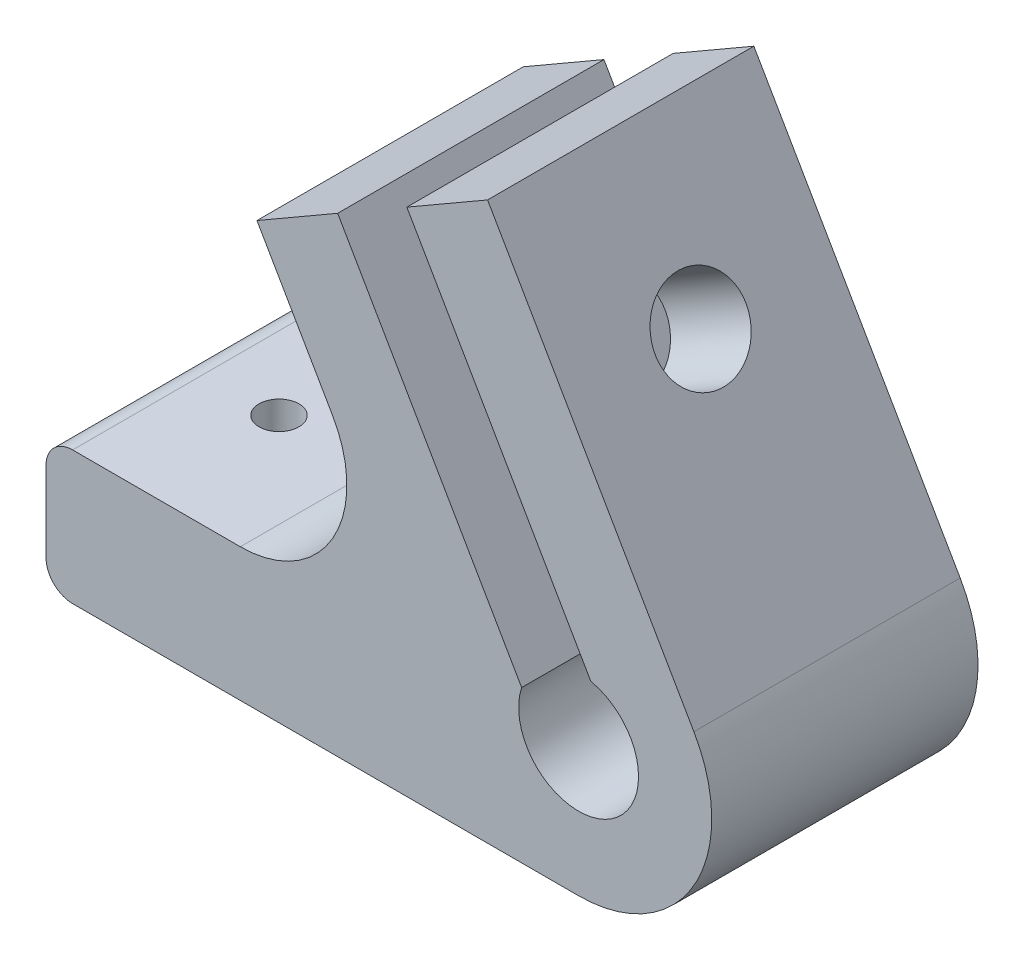
ISO-10303-21;
HEADER;
FILE_DESCRIPTION(('STEP AP214'),'2;1');
FILE_NAME('part.step','',(''),(''),'','','');
FILE_SCHEMA(('AUTOMOTIVE_DESIGN { 1 0 10303 214 1 1 1 1 }'));
ENDSEC;
DATA;
#1=APPLICATION_CONTEXT('core data for automotive mechanical design processes');
#2=APPLICATION_PROTOCOL_DEFINITION('international standard','automotive_design',2000,#1);
#3=PRODUCT_CONTEXT('',#1,'mechanical');
#4=PRODUCT('Part','Part','',(#3));
#5=PRODUCT_RELATED_PRODUCT_CATEGORY('part','',(#4));
#6=PRODUCT_DEFINITION_FORMATION('','',#4);
#7=PRODUCT_DEFINITION_CONTEXT('part definition',#1,'design');
#8=PRODUCT_DEFINITION('design','',#6,#7);
#9=PRODUCT_DEFINITION_SHAPE('','',#8);
#10=(LENGTH_UNIT() NAMED_UNIT(*) SI_UNIT(.MILLI.,.METRE.));
#11=(NAMED_UNIT(*) PLANE_ANGLE_UNIT() SI_UNIT($,.RADIAN.));
#12=(NAMED_UNIT(*) SI_UNIT($,.STERADIAN.) SOLID_ANGLE_UNIT());
#13=UNCERTAINTY_MEASURE_WITH_UNIT(LENGTH_MEASURE(1.E-05),#10,'distance_accuracy_value','');
#14=(GEOMETRIC_REPRESENTATION_CONTEXT(3) GLOBAL_UNCERTAINTY_ASSIGNED_CONTEXT((#13)) GLOBAL_UNIT_ASSIGNED_CONTEXT((#10,
#11,#12)) REPRESENTATION_CONTEXT('',''));
#15=CARTESIAN_POINT('',(0.,0.,0.));
#16=DIRECTION('',(0.,0.,1.));
#17=DIRECTION('',(1.,0.,0.));
#18=AXIS2_PLACEMENT_3D('',#15,#16,#17);
#19=CARTESIAN_POINT('',(671.535898384841,387.71143170301,0.));
#20=DIRECTION('',(0.866025403784425,0.500000000000023,0.));
#21=DIRECTION('',(-0.500000000000023,0.866025403784425,0.));
#22=AXIS2_PLACEMENT_3D('',#19,#20,#21);
#23=PLANE('',#22);
#24=DIRECTION('',(0.,0.,1.));
#25=VECTOR('',#24,1.);
#26=CARTESIAN_POINT('',(890.35832267251,8.69987500139835,3.35000000000008));
#27=LINE('',#26,#25);
#28=CARTESIAN_POINT('',(890.35832267251,8.69987500139835,3.35000000000008));
#29=VERTEX_POINT('',#28);
#30=CARTESIAN_POINT('',(890.35832267251,8.69987500139835,6.65));
#31=VERTEX_POINT('',#30);
#32=EDGE_CURVE('E217',#29,#31,#27,.T.);
#33=ORIENTED_EDGE('',*,*,#32,.F.);
#34=DIRECTION('',(-0.433012701892207,0.749999999999974,0.500000000000049));
#35=VECTOR('',#34,1.);
#36=CARTESIAN_POINT('',(891.787264588754,6.22487500139857,1.7));
#37=LINE('',#36,#35);
#38=CARTESIAN_POINT('',(891.787264588754,6.22487500139857,1.7));
#39=VERTEX_POINT('',#38);
#40=EDGE_CURVE('E232',#39,#29,#37,.T.);
#41=ORIENTED_EDGE('',*,*,#40,.F.);
#42=DIRECTION('',(-0.433012701892212,0.749999999999983,-0.500000000000032));
#43=VECTOR('',#42,1.);
#44=CARTESIAN_POINT('',(893.216206504998,3.74987500139878,3.35));
#45=LINE('',#44,#43);
#46=CARTESIAN_POINT('',(893.216206504998,3.74987500139878,3.35));
#47=VERTEX_POINT('',#46);
#48=EDGE_CURVE('E229',#47,#39,#45,.T.);
#49=ORIENTED_EDGE('',*,*,#48,.F.);
#50=DIRECTION('',(0.,0.,-1.));
#51=VECTOR('',#50,1.);
#52=CARTESIAN_POINT('',(893.216206504998,3.74987500139878,6.65));
#53=LINE('',#52,#51);
#54=CARTESIAN_POINT('',(893.216206504998,3.74987500139878,6.65));
#55=VERTEX_POINT('',#54);
#56=EDGE_CURVE('E226',#55,#47,#53,.T.);
#57=ORIENTED_EDGE('',*,*,#56,.F.);
#58=DIRECTION('',(0.433012701892198,-0.749999999999999,-0.500000000000021));
#59=VECTOR('',#58,1.);
#60=CARTESIAN_POINT('',(891.787264588754,6.22487500139851,8.29999999999989));
#61=LINE('',#60,#59);
#62=CARTESIAN_POINT('',(891.787264588754,6.22487500139851,8.29999999999989));
#63=VERTEX_POINT('',#62);
#64=EDGE_CURVE('E223',#63,#55,#61,.T.);
#65=ORIENTED_EDGE('',*,*,#64,.F.);
#66=DIRECTION('',(0.433012701892241,-0.749999999999991,0.499999999999993));
#67=VECTOR('',#66,1.);
#68=CARTESIAN_POINT('',(890.35832267251,8.69987500139835,6.65));
#69=LINE('',#68,#67);
#70=EDGE_CURVE('E220',#31,#63,#69,.T.);
#71=ORIENTED_EDGE('',*,*,#70,.F.);
#72=EDGE_LOOP('',(#33,#41,#49,#57,#65,#71));
#73=FACE_BOUND('',#72,.T.);
#74=CARTESIAN_POINT('',(891.787264588654,6.22487500145746,5.));
#75=DIRECTION('',(-0.86602540378449,-0.499999999999911,0.));
#76=DIRECTION('',(0.499999999999911,-0.86602540378449,0.));
#77=AXIS2_PLACEMENT_3D('',#74,#75,#76);
#78=CIRCLE('',#77,1.7);
#79=CARTESIAN_POINT('',(892.637264588654,4.75263181502383,5.));
#80=VERTEX_POINT('',#79);
#81=EDGE_CURVE('E200',#80,#80,#78,.T.);
#82=ORIENTED_EDGE('',*,*,#81,.F.);
#83=EDGE_LOOP('',(#82));
#84=FACE_BOUND('',#83,.T.);
#85=ADVANCED_FACE('F33',(#73,#84),#23,.F.);
#86=CARTESIAN_POINT('',(896.581493222814,15.9210274241055,0.));
#87=DIRECTION('',(-0.499999999999976,0.866025403784452,0.));
#88=DIRECTION('',(-0.866025403784452,-0.499999999999976,0.));
#89=AXIS2_PLACEMENT_3D('',#86,#87,#88);
#90=PLANE('',#89);
#91=DIRECTION('',(0.,0.,-1.));
#92=VECTOR('',#91,1.);
#93=CARTESIAN_POINT('',(890.952328098215,12.6710274241055,10.));
#94=LINE('',#93,#92);
#95=CARTESIAN_POINT('',(890.952328098215,12.6710274241055,10.));
#96=VERTEX_POINT('',#95);
#97=CARTESIAN_POINT('',(890.952328098215,12.6710274241055,0.));
#98=VERTEX_POINT('',#97);
#99=EDGE_CURVE('E260',#96,#98,#94,.T.);
#100=ORIENTED_EDGE('',*,*,#99,.T.);
#101=DIRECTION('',(-0.866025403784452,-0.499999999999976,0.));
#102=VECTOR('',#101,1.);
#103=CARTESIAN_POINT('',(896.581493222814,15.9210274241055,0.));
#104=LINE('',#103,#102);
#105=CARTESIAN_POINT('',(887.921239184969,10.9210274241055,0.));
#106=VERTEX_POINT('',#105);
#107=EDGE_CURVE('E281',#98,#106,#104,.T.);
#108=ORIENTED_EDGE('',*,*,#107,.T.);
#109=DIRECTION('',(0.,0.,1.));
#110=VECTOR('',#109,1.);
#111=CARTESIAN_POINT('',(887.921239184969,10.9210274241055,0.));
#112=LINE('',#111,#110);
#113=CARTESIAN_POINT('',(887.921239184969,10.9210274241055,10.));
#114=VERTEX_POINT('',#113);
#115=EDGE_CURVE('E329',#106,#114,#112,.T.);
#116=ORIENTED_EDGE('',*,*,#115,.T.);
#117=DIRECTION('',(-0.866025403784452,-0.499999999999976,0.));
#118=VECTOR('',#117,1.);
#119=CARTESIAN_POINT('',(896.581493222814,15.9210274241055,10.));
#120=LINE('',#119,#118);
#121=EDGE_CURVE('E304',#96,#114,#120,.T.);
#122=ORIENTED_EDGE('',*,*,#121,.F.);
#123=EDGE_LOOP('',(#100,#108,#116,#122));
#124=FACE_BOUND('',#123,.T.);
#125=ADVANCED_FACE('F360',(#124),#90,.T.);
#126=CARTESIAN_POINT('',(900.,0.,0.));
#127=DIRECTION('',(0.,0.,1.));
#128=DIRECTION('',(1.,0.,0.));
#129=AXIS2_PLACEMENT_3D('',#126,#127,#128);
#130=CYLINDRICAL_SURFACE('',#129,4.99999999999991);
#131=CARTESIAN_POINT('',(900.,0.,10.));
#132=DIRECTION('',(0.,0.,1.));
#133=DIRECTION('',(1.,0.,0.));
#134=AXIS2_PLACEMENT_3D('',#131,#132,#133);
#135=CIRCLE('',#134,4.99999999999991);
#136=CARTESIAN_POINT('',(900.,-5.,10.));
#137=VERTEX_POINT('',#136);
#138=CARTESIAN_POINT('',(904.330127018922,2.50000000000005,10.));
#139=VERTEX_POINT('',#138);
#140=EDGE_CURVE('E267',#137,#139,#135,.T.);
#141=ORIENTED_EDGE('',*,*,#140,.F.);
#142=DIRECTION('',(0.,0.,1.));
#143=VECTOR('',#142,1.);
#144=CARTESIAN_POINT('',(900.,-5.,0.));
#145=LINE('',#144,#143);
#146=CARTESIAN_POINT('',(900.,-5.,0.));
#147=VERTEX_POINT('',#146);
#148=EDGE_CURVE('E192',#147,#137,#145,.T.);
#149=ORIENTED_EDGE('',*,*,#148,.F.);
#150=CARTESIAN_POINT('',(900.,0.,0.));
#151=DIRECTION('',(0.,0.,1.));
#152=DIRECTION('',(1.,0.,0.));
#153=AXIS2_PLACEMENT_3D('',#150,#151,#152);
#154=CIRCLE('',#153,4.99999999999991);
#155=CARTESIAN_POINT('',(904.330127018922,2.50000000000005,0.));
#156=VERTEX_POINT('',#155);
#157=EDGE_CURVE('E274',#147,#156,#154,.T.);
#158=ORIENTED_EDGE('',*,*,#157,.T.);
#159=DIRECTION('',(0.,0.,1.));
#160=VECTOR('',#159,1.);
#161=CARTESIAN_POINT('',(904.330127018922,2.50000000000005,0.));
#162=LINE('',#161,#160);
#163=EDGE_CURVE('E298',#156,#139,#162,.T.);
#164=ORIENTED_EDGE('',*,*,#163,.T.);
#165=EDGE_LOOP('',(#141,#149,#158,#164));
#166=FACE_BOUND('',#165,.T.);
#167=ADVANCED_FACE('F345',(#166),#130,.T.);
#168=CARTESIAN_POINT('',(880.,-5.,0.));
#169=DIRECTION('',(0.,-1.,0.));
#170=DIRECTION('',(1.,0.,0.));
#171=AXIS2_PLACEMENT_3D('',#168,#169,#170);
#172=PLANE('',#171);
#173=CARTESIAN_POINT('',(890.25,-5.,5.));
#174=DIRECTION('',(0.,-1.,0.));
#175=DIRECTION('',(0.,0.,-1.));
#176=AXIS2_PLACEMENT_3D('',#173,#174,#175);
#177=CIRCLE('',#176,0.750000000000028);
#178=CARTESIAN_POINT('',(890.25,-5.,4.24999999999997));
#179=VERTEX_POINT('',#178);
#180=EDGE_CURVE('E201',#179,#179,#177,.T.);
#181=ORIENTED_EDGE('',*,*,#180,.F.);
#182=EDGE_LOOP('',(#181));
#183=FACE_BOUND('',#182,.T.);
#184=CARTESIAN_POINT('',(883.75,-5.,5.));
#185=DIRECTION('',(0.,1.,0.));
#186=DIRECTION('',(0.,0.,1.));
#187=AXIS2_PLACEMENT_3D('',#184,#185,#186);
#188=CIRCLE('',#187,0.750000000000028);
#189=CARTESIAN_POINT('',(883.75,-5.,5.75000000000003));
#190=VERTEX_POINT('',#189);
#191=EDGE_CURVE('E520',#190,#190,#188,.T.);
#192=ORIENTED_EDGE('',*,*,#191,.T.);
#193=EDGE_LOOP('',(#192));
#194=FACE_BOUND('',#193,.T.);
#195=DIRECTION('',(1.,0.,0.));
#196=VECTOR('',#195,1.);
#197=CARTESIAN_POINT('',(880.,-5.,10.));
#198=LINE('',#197,#196);
#199=CARTESIAN_POINT('',(881.,-5.,10.));
#200=VERTEX_POINT('',#199);
#201=EDGE_CURVE('E278',#200,#137,#198,.T.);
#202=ORIENTED_EDGE('',*,*,#201,.F.);
#203=DIRECTION('',(0.,0.,1.));
#204=VECTOR('',#203,1.);
#205=CARTESIAN_POINT('',(881.,-5.,0.));
#206=LINE('',#205,#204);
#207=CARTESIAN_POINT('',(881.,-5.,0.));
#208=VERTEX_POINT('',#207);
#209=EDGE_CURVE('E56',#200,#208,#206,.F.);
#210=ORIENTED_EDGE('',*,*,#209,.T.);
#211=DIRECTION('',(1.,0.,0.));
#212=VECTOR('',#211,1.);
#213=CARTESIAN_POINT('',(880.,-5.,0.));
#214=LINE('',#213,#212);
#215=EDGE_CURVE('E296',#208,#147,#214,.T.);
#216=ORIENTED_EDGE('',*,*,#215,.T.);
#217=ORIENTED_EDGE('',*,*,#148,.T.);
#218=EDGE_LOOP('',(#202,#210,#216,#217));
#219=FACE_BOUND('',#218,.T.);
#220=ADVANCED_FACE('F413',(#183,#194,#219),#172,.T.);
#221=CARTESIAN_POINT('',(880.,0.,0.));
#222=DIRECTION('',(-1.,0.,0.));
#223=DIRECTION('',(0.,0.,1.));
#224=AXIS2_PLACEMENT_3D('',#221,#222,#223);
#225=PLANE('',#224);
#226=DIRECTION('',(0.,-1.,0.));
#227=VECTOR('',#226,1.);
#228=CARTESIAN_POINT('',(880.,0.,0.));
#229=LINE('',#228,#227);
#230=CARTESIAN_POINT('',(880.,-1.,0.));
#231=VERTEX_POINT('',#230);
#232=CARTESIAN_POINT('',(880.,-4.,0.));
#233=VERTEX_POINT('',#232);
#234=EDGE_CURVE('E293',#231,#233,#229,.T.);
#235=ORIENTED_EDGE('',*,*,#234,.T.);
#236=DIRECTION('',(0.,0.,1.));
#237=VECTOR('',#236,1.);
#238=CARTESIAN_POINT('',(880.,-4.,0.));
#239=LINE('',#238,#237);
#240=CARTESIAN_POINT('',(880.,-4.,10.));
#241=VERTEX_POINT('',#240);
#242=EDGE_CURVE('E438',#233,#241,#239,.T.);
#243=ORIENTED_EDGE('',*,*,#242,.T.);
#244=DIRECTION('',(0.,-1.,0.));
#245=VECTOR('',#244,1.);
#246=CARTESIAN_POINT('',(880.,0.,10.));
#247=LINE('',#246,#245);
#248=CARTESIAN_POINT('',(880.,-1.,10.));
#249=VERTEX_POINT('',#248);
#250=EDGE_CURVE('E317',#249,#241,#247,.T.);
#251=ORIENTED_EDGE('',*,*,#250,.F.);
#252=DIRECTION('',(0.,0.,1.));
#253=VECTOR('',#252,1.);
#254=CARTESIAN_POINT('',(880.,-1.,0.));
#255=LINE('',#254,#253);
#256=EDGE_CURVE('E191',#249,#231,#255,.F.);
#257=ORIENTED_EDGE('',*,*,#256,.T.);
#258=EDGE_LOOP('',(#235,#243,#251,#257));
#259=FACE_BOUND('',#258,.T.);
#260=ADVANCED_FACE('F416',(#259),#225,.T.);
#261=CARTESIAN_POINT('',(887.298294077828,0.,0.));
#262=DIRECTION('',(0.,1.,0.));
#263=DIRECTION('',(0.,0.,1.));
#264=AXIS2_PLACEMENT_3D('',#261,#262,#263);
#265=PLANE('',#264);
#266=CARTESIAN_POINT('',(883.75,0.,5.));
#267=DIRECTION('',(0.,1.,0.));
#268=DIRECTION('',(0.,0.,1.));
#269=AXIS2_PLACEMENT_3D('',#266,#267,#268);
#270=CIRCLE('',#269,0.750000000000028);
#271=CARTESIAN_POINT('',(883.75,0.,5.75000000000003));
#272=VERTEX_POINT('',#271);
#273=EDGE_CURVE('E430',#272,#272,#270,.T.);
#274=ORIENTED_EDGE('',*,*,#273,.F.);
#275=EDGE_LOOP('',(#274));
#276=FACE_BOUND('',#275,.T.);
#277=DIRECTION('',(-1.,0.,0.));
#278=VECTOR('',#277,1.);
#279=CARTESIAN_POINT('',(887.298294077828,0.,0.));
#280=LINE('',#279,#278);
#281=CARTESIAN_POINT('',(887.298294077828,-1.0321604682062E-13,0.));
#282=VERTEX_POINT('',#281);
#283=CARTESIAN_POINT('',(881.,0.,0.));
#284=VERTEX_POINT('',#283);
#285=EDGE_CURVE('E291',#282,#284,#280,.T.);
#286=ORIENTED_EDGE('',*,*,#285,.T.);
#287=DIRECTION('',(0.,0.,1.));
#288=VECTOR('',#287,1.);
#289=CARTESIAN_POINT('',(881.,0.,0.));
#290=LINE('',#289,#288);
#291=CARTESIAN_POINT('',(881.,0.,10.));
#292=VERTEX_POINT('',#291);
#293=EDGE_CURVE('E11',#284,#292,#290,.T.);
#294=ORIENTED_EDGE('',*,*,#293,.T.);
#295=DIRECTION('',(-1.,0.,0.));
#296=VECTOR('',#295,1.);
#297=CARTESIAN_POINT('',(887.298294077828,0.,10.));
#298=LINE('',#297,#296);
#299=CARTESIAN_POINT('',(887.298294077828,-1.0321604682062E-13,10.));
#300=VERTEX_POINT('',#299);
#301=EDGE_CURVE('E314',#300,#292,#298,.T.);
#302=ORIENTED_EDGE('',*,*,#301,.F.);
#303=DIRECTION('',(0.,0.,1.));
#304=VECTOR('',#303,1.);
#305=CARTESIAN_POINT('',(887.298294077828,-1.0321604682062E-13,0.));
#306=LINE('',#305,#304);
#307=EDGE_CURVE('E323',#282,#300,#306,.T.);
#308=ORIENTED_EDGE('',*,*,#307,.F.);
#309=EDGE_LOOP('',(#286,#294,#302,#308));
#310=FACE_BOUND('',#309,.T.);
#311=ADVANCED_FACE('F419',(#276,#310),#265,.T.);
#312=CARTESIAN_POINT('',(887.298294077828,4.,0.));
#313=DIRECTION('',(0.,0.,1.));
#314=DIRECTION('',(1.,0.,0.));
#315=AXIS2_PLACEMENT_3D('',#312,#313,#314);
#316=CYLINDRICAL_SURFACE('',#315,4.0000000000001);
#317=CARTESIAN_POINT('',(890.25,1.30047556984277,4.24999999999997));
#318=CARTESIAN_POINT('',(890.207289859515,1.25377678097808,4.24999927254429));
#319=CARTESIAN_POINT('',(890.163439163644,1.20806512073884,4.25363777597788));
#320=CARTESIAN_POINT('',(890.074340380105,1.11946101671976,4.26945991314147));
#321=CARTESIAN_POINT('',(890.029092151555,1.07656885853965,4.28164441107841));
#322=CARTESIAN_POINT('',(889.946695209342,1.0019171286196,4.31291131609085));
#323=CARTESIAN_POINT('',(889.909522209766,0.969526656491228,4.33040280793495));
#324=CARTESIAN_POINT('',(889.836590527487,0.908186466133607,4.37281116100972));
#325=CARTESIAN_POINT('',(889.800829980071,0.879232102864127,4.39771783448767));
#326=CARTESIAN_POINT('',(889.738348697495,0.830231211689722,4.45037884017179));
#327=CARTESIAN_POINT('',(889.711130415431,0.809508916401523,4.47690877706049));
#328=CARTESIAN_POINT('',(889.660082272199,0.771537852807935,4.53524548363739));
#329=CARTESIAN_POINT('',(889.636251703842,0.754288359238368,4.56705114900008));
#330=CARTESIAN_POINT('',(889.593161632617,0.723677377572927,4.63569757420792));
#331=CARTESIAN_POINT('',(889.573935813151,0.710344387045654,4.67257250560846));
#332=CARTESIAN_POINT('',(889.541588369256,0.688199926574818,4.75016956582247));
#333=CARTESIAN_POINT('',(889.52846250356,0.679385314585424,4.79088899780237));
#334=CARTESIAN_POINT('',(889.510512299779,0.667404700849729,4.86935465534752));
#335=CARTESIAN_POINT('',(889.504845771444,0.663663768749288,4.90682230249688));
#336=CARTESIAN_POINT('',(889.499253176158,0.659971305242352,4.9823623397989));
#337=CARTESIAN_POINT('',(889.499324380276,0.660017972410782,5.02043443385533));
#338=CARTESIAN_POINT('',(889.505001225954,0.663766716468235,5.09342576193545));
#339=CARTESIAN_POINT('',(889.510240568346,0.667226860046474,5.1283870001424));
#340=CARTESIAN_POINT('',(889.525427931822,0.67735687201954,5.19677950894418));
#341=CARTESIAN_POINT('',(889.535375656942,0.684026538666893,5.23021087556062));
#342=CARTESIAN_POINT('',(889.559657327781,0.700537412390165,5.29521083795891));
#343=CARTESIAN_POINT('',(889.574056034241,0.710425568358397,5.3267431213758));
#344=CARTESIAN_POINT('',(889.606491224889,0.733102900421876,5.38673039969089));
#345=CARTESIAN_POINT('',(889.624528559977,0.745892755172402,5.41518467239481));
#346=CARTESIAN_POINT('',(889.665154345153,0.775306006846336,5.47089690921792));
#347=CARTESIAN_POINT('',(889.688000775525,0.792164481689388,5.49784159123945));
#348=CARTESIAN_POINT('',(889.736117505188,0.828575929950352,5.5473753857951));
#349=CARTESIAN_POINT('',(889.76138922037,0.848130480292535,5.56996193058282));
#350=CARTESIAN_POINT('',(889.824640688902,0.898417352332341,5.61951596553867));
#351=CARTESIAN_POINT('',(889.86343518944,0.930354844005358,5.64422952592513));
#352=CARTESIAN_POINT('',(889.942189133565,0.997912101905187,5.68537284082185));
#353=CARTESIAN_POINT('',(889.982150680524,1.03353885433887,5.70178651934307));
#354=CARTESIAN_POINT('',(890.076001710377,1.12080656866104,5.73173812067684));
#355=CARTESIAN_POINT('',(890.129779398905,1.17362980730254,5.74216648659633));
#356=CARTESIAN_POINT('',(890.234668093845,1.28274332919684,5.75169613712167));
#357=CARTESIAN_POINT('',(890.28577500274,1.33903866665722,5.75078050206043));
#358=CARTESIAN_POINT('',(890.402604968354,1.47532324725379,5.73745930530794));
#359=CARTESIAN_POINT('',(890.466684678905,1.55632989478179,5.72090242836515));
#360=CARTESIAN_POINT('',(890.556552525139,1.67914654788958,5.68524819075188));
#361=CARTESIAN_POINT('',(890.585506882716,1.7203687076658,5.67153032481372));
#362=CARTESIAN_POINT('',(890.641270669918,1.80295969809729,5.64064130671149));
#363=CARTESIAN_POINT('',(890.668080705546,1.84432848383883,5.62347113505225));
#364=CARTESIAN_POINT('',(890.733036009689,1.94864995306264,5.57581202108023));
#365=CARTESIAN_POINT('',(890.769729963256,2.0115152775287,5.54306684247554));
#366=CARTESIAN_POINT('',(890.820538204864,2.10394223268139,5.48744984353042));
#367=CARTESIAN_POINT('',(890.836738645291,2.13437620692916,5.46787644309277));
#368=CARTESIAN_POINT('',(890.867678578572,2.19427990558348,5.42620361788595));
#369=CARTESIAN_POINT('',(890.882418026833,2.22374960054019,5.40410411606008));
#370=CARTESIAN_POINT('',(890.906069099155,2.2724413176872,5.36392514395243));
#371=CARTESIAN_POINT('',(890.915405670066,2.29209314140444,5.34661894347754));
#372=CARTESIAN_POINT('',(890.933126213484,2.33013952290605,5.31023854637207));
#373=CARTESIAN_POINT('',(890.941511081152,2.34853525555532,5.29116604229669));
#374=CARTESIAN_POINT('',(890.957211736919,2.38361692035779,5.25065917588991));
#375=CARTESIAN_POINT('',(890.964514450805,2.40028131292284,5.22920067825156));
#376=CARTESIAN_POINT('',(890.977532099372,2.43045363302456,5.18371792058023));
#377=CARTESIAN_POINT('',(890.983252118487,2.44397164560161,5.15970222819062));
#378=CARTESIAN_POINT('',(890.990723525909,2.46181238132935,5.11867170607103));
#379=CARTESIAN_POINT('',(890.993157116186,2.46767757859204,5.10246164109584));
#380=CARTESIAN_POINT('',(890.996983923832,2.47693770746652,5.06923484783762));
#381=CARTESIAN_POINT('',(890.998378758168,2.48033647819954,5.05221941732139));
#382=CARTESIAN_POINT('',(890.999991827862,2.4842695009313,5.01767758596484));
#383=CARTESIAN_POINT('',(891.000202186792,2.48478457704332,5.00014854193352));
#384=CARTESIAN_POINT('',(890.999399472144,2.48282510014523,4.96528463497851));
#385=CARTESIAN_POINT('',(890.998385637975,2.48034868851925,4.94794989953537));
#386=CARTESIAN_POINT('',(890.995003895518,2.47213928183054,4.91135590745136));
#387=CARTESIAN_POINT('',(890.992449922829,2.46595971889299,4.89221661488658));
#388=CARTESIAN_POINT('',(890.986142528037,2.450858063756,4.85526730278333));
#389=CARTESIAN_POINT('',(890.982386502243,2.44193001985901,4.83746027324097));
#390=CARTESIAN_POINT('',(890.971170856267,2.41561073572278,4.79198995984664));
#391=CARTESIAN_POINT('',(890.962898883968,2.39651196064573,4.76553337439091));
#392=CARTESIAN_POINT('',(890.944581872799,2.35528093226421,4.7158165244182));
#393=CARTESIAN_POINT('',(890.934531504553,2.33313960710413,4.69256625181507));
#394=CARTESIAN_POINT('',(890.91248920255,2.28585024870313,4.6474816670823));
#395=CARTESIAN_POINT('',(890.900422673786,2.26060511261087,4.6257873726835));
#396=CARTESIAN_POINT('',(890.874995307365,2.20889883922494,4.58471343798303));
#397=CARTESIAN_POINT('',(890.8616331431,2.18243647048324,4.56533621644589));
#398=CARTESIAN_POINT('',(890.819737219639,2.10181762612304,4.51004889428271));
#399=CARTESIAN_POINT('',(890.789445752486,2.04654231838361,4.47708249871937));
#400=CARTESIAN_POINT('',(890.731642431999,1.9470274789208,4.42406626883133));
#401=CARTESIAN_POINT('',(890.70493165031,1.90296844994739,4.4027630575789));
#402=CARTESIAN_POINT('',(890.649004762684,1.81471389015163,4.36403273874998));
#403=CARTESIAN_POINT('',(890.619787014226,1.77051828840984,4.34660819969521));
#404=CARTESIAN_POINT('',(890.528685196669,1.63866812263388,4.30038180972725));
#405=CARTESIAN_POINT('',(890.463101952889,1.55131258396583,4.27739803690014));
#406=CARTESIAN_POINT('',(890.370324299513,1.43797596515017,4.25934700279522));
#407=CARTESIAN_POINT('',(890.34685446278,1.41009326982196,4.25589337252747));
#408=CARTESIAN_POINT('',(890.299050654258,1.35485522157624,4.25121959253168));
#409=CARTESIAN_POINT('',(890.274716308764,1.32750010479809,4.25000042097773));
#410=CARTESIAN_POINT('',(890.25,1.30047556984277,4.24999999999997));
#411=B_SPLINE_CURVE_WITH_KNOTS('',3,(#317,#318,#319,#320,#321,#322,#323,#324,#325,#326,#327,
#328,#329,#330,#331,#332,#333,#334,#335,#336,#337,#338,#339,#340,#341,#342,#343,#344,#345,#346,
#347,#348,#349,#350,#351,#352,#353,#354,#355,#356,#357,#358,#359,#360,#361,#362,#363,#364,#365,
#366,#367,#368,#369,#370,#371,#372,#373,#374,#375,#376,#377,#378,#379,#380,#381,#382,#383,#384,
#385,#386,#387,#388,#389,#390,#391,#392,#393,#394,#395,#396,#397,#398,#399,#400,#401,#402,#403,
#404,#405,#406,#407,#408,#409,#410),.UNSPECIFIED.,.T.,.F.,(4,2,2,2,2,2,2,2,2,2,2,2,2,2,2,2,2,2,
2,2,2,2,2,2,2,2,2,2,2,2,2,2,2,2,2,2,2,2,2,2,2,2,2,2,2,2,4),(0.,0.189769236759739,
0.379557666550801,0.535952558669907,0.692133562985383,0.821482107929837,0.950803611479649,
1.08104402308513,1.21119374322078,1.32482483942003,1.43840189170086,1.54446818712287,
1.65052781619223,1.75820964385138,1.86591668236812,1.98288567303332,2.09992337096152,
2.2669864665065,2.43437191782586,2.66141074590936,2.88878824491452,3.20082952124407,
3.35734046270749,3.51380701542741,3.75253743244876,3.87139477962688,3.99025575342095,
4.07358322107465,4.15683165071507,4.24101568911549,4.32492605905663,4.37697118343322,
4.42893512207771,4.48124420185524,4.53358579806549,4.59406755248091,4.65468120949401,
4.75509955061913,4.85582407863925,4.96187822377448,5.06804212857048,5.28084280812734,
5.44792322586198,5.61511396004948,5.94785118188879,6.05762237628253,6.16744161350339),.UNSPECIFIED.);
#412=CARTESIAN_POINT('',(890.992453738688,2.46599074315856,4.89387532846635));
#413=VERTEX_POINT('',#412);
#414=CARTESIAN_POINT('',(890.992453738687,2.46599074315664,5.10612467153937));
#415=VERTEX_POINT('',#414);
#416=EDGE_CURVE('E184',#413,#415,#411,.T.);
#417=ORIENTED_EDGE('',*,*,#416,.F.);
#418=DIRECTION('',(0.,0.,1.));
#419=VECTOR('',#418,1.);
#420=CARTESIAN_POINT('',(890.992453738688,2.46599074315856,0.));
#421=LINE('',#420,#419);
#422=CARTESIAN_POINT('',(890.992453738688,2.46599074315856,3.35));
#423=VERTEX_POINT('',#422);
#424=EDGE_CURVE('E199',#413,#423,#421,.F.);
#425=ORIENTED_EDGE('',*,*,#424,.T.);
#426=CARTESIAN_POINT('',(887.298294077828,4.,1.51658333426561));
#427=DIRECTION('',(0.250000000000016,-0.433012701892247,-0.86602540378442));
#428=DIRECTION('',(0.43301270189221,-0.749999999999984,0.500000000000032));
#429=AXIS2_PLACEMENT_3D('',#426,#427,#428);
#430=ELLIPSE('',#429,4.61880215351723,4.0000000000001);
#431=CARTESIAN_POINT('',(890.910296447605,5.71855720903543,1.7));
#432=VERTEX_POINT('',#431);
#433=EDGE_CURVE('E207',#423,#432,#430,.F.);
#434=ORIENTED_EDGE('',*,*,#433,.T.);
#435=CARTESIAN_POINT('',(887.298294077828,4.,1.88341666573439));
#436=DIRECTION('',(-0.250000000000025,0.433012701892262,-0.86602540378441));
#437=DIRECTION('',(-0.433012701892205,0.749999999999975,0.500000000000049));
#438=AXIS2_PLACEMENT_3D('',#435,#436,#437);
#439=ELLIPSE('',#438,4.61880215351728,4.0000000000001);
#440=CARTESIAN_POINT('',(890.762395692966,6.,1.88341666573433));
#441=VERTEX_POINT('',#440);
#442=EDGE_CURVE('E210',#432,#441,#439,.F.);
#443=ORIENTED_EDGE('',*,*,#442,.T.);
#444=DIRECTION('',(0.,0.,1.));
#445=VECTOR('',#444,1.);
#446=CARTESIAN_POINT('',(890.762395692966,6.,0.));
#447=LINE('',#446,#445);
#448=CARTESIAN_POINT('',(890.762395692966,6.,0.));
#449=VERTEX_POINT('',#448);
#450=EDGE_CURVE('E325',#449,#441,#447,.T.);
#451=ORIENTED_EDGE('',*,*,#450,.F.);
#452=CARTESIAN_POINT('',(887.298294077828,4.,0.));
#453=DIRECTION('',(0.,0.,-1.));
#454=DIRECTION('',(-1.,0.,0.));
#455=AXIS2_PLACEMENT_3D('',#452,#453,#454);
#456=CIRCLE('',#455,4.0000000000001);
#457=EDGE_CURVE('E288',#449,#282,#456,.T.);
#458=ORIENTED_EDGE('',*,*,#457,.T.);
#459=ORIENTED_EDGE('',*,*,#307,.T.);
#460=CARTESIAN_POINT('',(887.298294077828,4.,10.));
#461=DIRECTION('',(0.,0.,-1.));
#462=DIRECTION('',(-1.,0.,0.));
#463=AXIS2_PLACEMENT_3D('',#460,#461,#462);
#464=CIRCLE('',#463,4.0000000000001);
#465=CARTESIAN_POINT('',(890.762395692966,6.,10.));
#466=VERTEX_POINT('',#465);
#467=EDGE_CURVE('E311',#466,#300,#464,.T.);
#468=ORIENTED_EDGE('',*,*,#467,.F.);
#469=CARTESIAN_POINT('',(890.762395692966,6.,8.11658333426553));
#470=VERTEX_POINT('',#469);
#471=EDGE_CURVE('E328',#470,#466,#447,.T.);
#472=ORIENTED_EDGE('',*,*,#471,.F.);
#473=CARTESIAN_POINT('',(887.298294077828,4.,8.11658333426546));
#474=DIRECTION('',(-0.249999999999997,0.433012701892214,0.866025403784442));
#475=DIRECTION('',(0.433012701892221,-0.750000000000003,0.499999999999993));
#476=AXIS2_PLACEMENT_3D('',#473,#474,#475);
#477=ELLIPSE('',#476,4.61880215351711,4.0000000000001);
#478=CARTESIAN_POINT('',(890.910296447605,5.71855720903536,8.29999999999989));
#479=VERTEX_POINT('',#478);
#480=EDGE_CURVE('E250',#470,#479,#477,.F.);
#481=ORIENTED_EDGE('',*,*,#480,.T.);
#482=CARTESIAN_POINT('',(887.298294077828,4.,8.48341666573433));
#483=DIRECTION('',(0.25000000000001,-0.433012701892237,0.866025403784427));
#484=DIRECTION('',(-0.433012701892213,0.74999999999999,0.500000000000021));
#485=AXIS2_PLACEMENT_3D('',#482,#483,#484);
#486=ELLIPSE('',#485,4.61880215351719,4.0000000000001);
#487=CARTESIAN_POINT('',(890.992453738688,2.46599074315853,6.65));
#488=VERTEX_POINT('',#487);
#489=EDGE_CURVE('E206',#479,#488,#486,.F.);
#490=ORIENTED_EDGE('',*,*,#489,.T.);
#491=EDGE_CURVE('E196',#488,#415,#421,.F.);
#492=ORIENTED_EDGE('',*,*,#491,.T.);
#493=EDGE_LOOP('',(#417,#425,#434,#443,#451,#458,#459,#468,#472,#481,#490,#492));
#494=FACE_BOUND('',#493,.T.);
#495=ADVANCED_FACE('F204',(#494),#316,.F.);
#496=CARTESIAN_POINT('',(887.921239184969,10.9210274241055,0.));
#497=DIRECTION('',(-0.866025403784428,-0.500000000000018,0.));
#498=DIRECTION('',(0.500000000000018,-0.866025403784428,0.));
#499=AXIS2_PLACEMENT_3D('',#496,#497,#498);
#500=PLANE('',#499);
#501=DIRECTION('',(0.433012701892237,-0.749999999999994,0.499999999999994));
#502=VECTOR('',#501,1.);
#503=CARTESIAN_POINT('',(889.492297268725,8.19987500139851,6.64999999999987));
#504=LINE('',#503,#502);
#505=CARTESIAN_POINT('',(889.492297268725,8.19987500139831,6.65));
#506=VERTEX_POINT('',#505);
#507=EDGE_CURVE('E238',#506,#470,#504,.T.);
#508=ORIENTED_EDGE('',*,*,#507,.T.);
#509=ORIENTED_EDGE('',*,*,#471,.T.);
#510=DIRECTION('',(0.500000000000018,-0.866025403784428,0.));
#511=VECTOR('',#510,1.);
#512=CARTESIAN_POINT('',(887.921239184969,10.9210274241055,10.));
#513=LINE('',#512,#511);
#514=EDGE_CURVE('E308',#114,#466,#513,.T.);
#515=ORIENTED_EDGE('',*,*,#514,.F.);
#516=ORIENTED_EDGE('',*,*,#115,.F.);
#517=DIRECTION('',(0.500000000000018,-0.866025403784428,0.));
#518=VECTOR('',#517,1.);
#519=CARTESIAN_POINT('',(887.921239184969,10.9210274241055,0.));
#520=LINE('',#519,#518);
#521=EDGE_CURVE('E285',#106,#449,#520,.T.);
#522=ORIENTED_EDGE('',*,*,#521,.T.);
#523=ORIENTED_EDGE('',*,*,#450,.T.);
#524=DIRECTION('',(-0.433012701892221,0.749999999999966,0.500000000000049));
#525=VECTOR('',#524,1.);
#526=CARTESIAN_POINT('',(890.921239184969,5.72487500139875,1.70000000000013));
#527=LINE('',#526,#525);
#528=CARTESIAN_POINT('',(889.492297268725,8.19987500139831,3.35000000000008));
#529=VERTEX_POINT('',#528);
#530=EDGE_CURVE('E468',#441,#529,#527,.T.);
#531=ORIENTED_EDGE('',*,*,#530,.T.);
#532=DIRECTION('',(0.,0.,1.));
#533=VECTOR('',#532,1.);
#534=CARTESIAN_POINT('',(889.492297268725,8.19987500139831,3.35000000000008));
#535=LINE('',#534,#533);
#536=EDGE_CURVE('E464',#529,#506,#535,.T.);
#537=ORIENTED_EDGE('',*,*,#536,.T.);
#538=EDGE_LOOP('',(#508,#509,#515,#516,#522,#523,#531,#537));
#539=FACE_BOUND('',#538,.T.);
#540=ADVANCED_FACE('F426',(#539),#500,.T.);
#541=DIRECTION('',(0.,0.,-1.));
#542=VECTOR('',#541,1.);
#543=CARTESIAN_POINT('',(893.550404309568,14.1710274241056,10.));
#544=LINE('',#543,#542);
#545=CARTESIAN_POINT('',(893.550404309568,14.1710274241056,10.));
#546=VERTEX_POINT('',#545);
#547=CARTESIAN_POINT('',(893.550404309568,14.1710274241056,0.));
#548=VERTEX_POINT('',#547);
#549=EDGE_CURVE('E270',#546,#548,#544,.T.);
#550=ORIENTED_EDGE('',*,*,#549,.F.);
#551=CARTESIAN_POINT('',(896.581493222814,15.9210274241055,10.));
#552=VERTEX_POINT('',#551);
#553=EDGE_CURVE('E305',#552,#546,#120,.T.);
#554=ORIENTED_EDGE('',*,*,#553,.F.);
#555=DIRECTION('',(0.,0.,1.));
#556=VECTOR('',#555,1.);
#557=CARTESIAN_POINT('',(896.581493222814,15.9210274241055,0.));
#558=LINE('',#557,#556);
#559=CARTESIAN_POINT('',(896.581493222814,15.9210274241055,0.));
#560=VERTEX_POINT('',#559);
#561=EDGE_CURVE('E332',#560,#552,#558,.T.);
#562=ORIENTED_EDGE('',*,*,#561,.F.);
#563=EDGE_CURVE('E282',#560,#548,#104,.T.);
#564=ORIENTED_EDGE('',*,*,#563,.T.);
#565=EDGE_LOOP('',(#550,#554,#562,#564));
#566=FACE_BOUND('',#565,.T.);
#567=ADVANCED_FACE('F368',(#566),#90,.T.);
#568=CARTESIAN_POINT('',(904.330127018922,2.50000000000005,0.));
#569=DIRECTION('',(0.866025403784456,0.499999999999969,0.));
#570=DIRECTION('',(-0.499999999999969,0.866025403784457,0.));
#571=AXIS2_PLACEMENT_3D('',#568,#569,#570);
#572=PLANE('',#571);
#573=CARTESIAN_POINT('',(899.581493222814,10.7248750013989,5.));
#574=DIRECTION('',(0.866025403784456,0.499999999999969,0.));
#575=DIRECTION('',(-0.499999999999969,0.866025403784457,0.));
#576=AXIS2_PLACEMENT_3D('',#573,#574,#575);
#577=CIRCLE('',#576,1.69999999999983);
#578=CARTESIAN_POINT('',(898.731493222814,12.1971181878323,5.));
#579=VERTEX_POINT('',#578);
#580=EDGE_CURVE('E526',#579,#579,#577,.T.);
#581=ORIENTED_EDGE('',*,*,#580,.F.);
#582=EDGE_LOOP('',(#581));
#583=FACE_BOUND('',#582,.T.);
#584=DIRECTION('',(-0.499999999999969,0.866025403784457,0.));
#585=VECTOR('',#584,1.);
#586=CARTESIAN_POINT('',(904.330127018922,2.50000000000005,10.));
#587=LINE('',#586,#585);
#588=EDGE_CURVE('E301',#139,#552,#587,.T.);
#589=ORIENTED_EDGE('',*,*,#588,.F.);
#590=ORIENTED_EDGE('',*,*,#163,.F.);
#591=DIRECTION('',(-0.499999999999969,0.866025403784457,0.));
#592=VECTOR('',#591,1.);
#593=CARTESIAN_POINT('',(904.330127018922,2.50000000000005,0.));
#594=LINE('',#593,#592);
#595=EDGE_CURVE('E277',#156,#560,#594,.T.);
#596=ORIENTED_EDGE('',*,*,#595,.T.);
#597=ORIENTED_EDGE('',*,*,#561,.T.);
#598=EDGE_LOOP('',(#589,#590,#596,#597));
#599=FACE_BOUND('',#598,.T.);
#600=ADVANCED_FACE('F409',(#583,#599),#572,.T.);
#601=CARTESIAN_POINT('',(900.,0.,0.));
#602=DIRECTION('',(0.,0.,1.));
#603=DIRECTION('',(1.,0.,0.));
#604=AXIS2_PLACEMENT_3D('',#601,#602,#603);
#605=PLANE('',#604);
#606=ORIENTED_EDGE('',*,*,#215,.F.);
#607=CARTESIAN_POINT('',(881.,-4.,0.));
#608=DIRECTION('',(0.,0.,1.));
#609=DIRECTION('',(1.,0.,0.));
#610=AXIS2_PLACEMENT_3D('',#607,#608,#609);
#611=CIRCLE('',#610,1.);
#612=EDGE_CURVE('E41',#208,#233,#611,.F.);
#613=ORIENTED_EDGE('',*,*,#612,.T.);
#614=ORIENTED_EDGE('',*,*,#234,.F.);
#615=CARTESIAN_POINT('',(881.,-1.,0.));
#616=DIRECTION('',(0.,0.,1.));
#617=DIRECTION('',(1.,0.,0.));
#618=AXIS2_PLACEMENT_3D('',#615,#616,#617);
#619=CIRCLE('',#618,1.);
#620=EDGE_CURVE('E48',#231,#284,#619,.F.);
#621=ORIENTED_EDGE('',*,*,#620,.T.);
#622=ORIENTED_EDGE('',*,*,#285,.F.);
#623=ORIENTED_EDGE('',*,*,#457,.F.);
#624=ORIENTED_EDGE('',*,*,#521,.F.);
#625=ORIENTED_EDGE('',*,*,#107,.F.);
#626=DIRECTION('',(-0.499999999999982,0.866025403784449,0.));
#627=VECTOR('',#626,1.);
#628=CARTESIAN_POINT('',(897.862436402761,0.702368754827724,0.));
#629=LINE('',#628,#627);
#630=CARTESIAN_POINT('',(897.862436402761,0.702368754827688,0.));
#631=VERTEX_POINT('',#630);
#632=EDGE_CURVE('E252',#631,#98,#629,.T.);
#633=ORIENTED_EDGE('',*,*,#632,.F.);
#634=CARTESIAN_POINT('',(900.,0.,0.));
#635=DIRECTION('',(0.,0.,1.));
#636=DIRECTION('',(1.,0.,0.));
#637=AXIS2_PLACEMENT_3D('',#634,#635,#636);
#638=CIRCLE('',#637,2.24999999999986);
#639=CARTESIAN_POINT('',(900.460512614114,2.20236875482769,0.));
#640=VERTEX_POINT('',#639);
#641=EDGE_CURVE('E461',#631,#640,#638,.T.);
#642=ORIENTED_EDGE('',*,*,#641,.T.);
#643=DIRECTION('',(0.499999999999983,-0.866025403784449,0.));
#644=VECTOR('',#643,1.);
#645=CARTESIAN_POINT('',(893.550404309568,14.1710274241056,0.));
#646=LINE('',#645,#644);
#647=EDGE_CURVE('E257',#548,#640,#646,.T.);
#648=ORIENTED_EDGE('',*,*,#647,.F.);
#649=ORIENTED_EDGE('',*,*,#563,.F.);
#650=ORIENTED_EDGE('',*,*,#595,.F.);
#651=ORIENTED_EDGE('',*,*,#157,.F.);
#652=EDGE_LOOP('',(#606,#613,#614,#621,#622,#623,#624,#625,#633,#642,#648,#649,#650,#651));
#653=FACE_BOUND('',#652,.T.);
#654=ADVANCED_FACE('F406',(#653),#605,.F.);
#655=CARTESIAN_POINT('',(900.,0.,10.));
#656=DIRECTION('',(0.,0.,1.));
#657=DIRECTION('',(1.,0.,0.));
#658=AXIS2_PLACEMENT_3D('',#655,#656,#657);
#659=PLANE('',#658);
#660=ORIENTED_EDGE('',*,*,#250,.T.);
#661=CARTESIAN_POINT('',(881.,-4.,10.));
#662=DIRECTION('',(0.,0.,1.));
#663=DIRECTION('',(1.,0.,0.));
#664=AXIS2_PLACEMENT_3D('',#661,#662,#663);
#665=CIRCLE('',#664,1.);
#666=EDGE_CURVE('E437',#241,#200,#665,.T.);
#667=ORIENTED_EDGE('',*,*,#666,.T.);
#668=ORIENTED_EDGE('',*,*,#201,.T.);
#669=ORIENTED_EDGE('',*,*,#140,.T.);
#670=ORIENTED_EDGE('',*,*,#588,.T.);
#671=ORIENTED_EDGE('',*,*,#553,.T.);
#672=DIRECTION('',(0.499999999999983,-0.866025403784449,0.));
#673=VECTOR('',#672,1.);
#674=CARTESIAN_POINT('',(893.550404309568,14.1710274241056,10.));
#675=LINE('',#674,#673);
#676=CARTESIAN_POINT('',(900.460512614114,2.20236875482775,10.));
#677=VERTEX_POINT('',#676);
#678=EDGE_CURVE('E256',#546,#677,#675,.T.);
#679=ORIENTED_EDGE('',*,*,#678,.T.);
#680=CARTESIAN_POINT('',(900.,0.,10.));
#681=DIRECTION('',(0.,0.,1.));
#682=DIRECTION('',(1.,0.,0.));
#683=AXIS2_PLACEMENT_3D('',#680,#681,#682);
#684=CIRCLE('',#683,2.24999999999986);
#685=CARTESIAN_POINT('',(897.862436402761,0.702368754827691,10.));
#686=VERTEX_POINT('',#685);
#687=EDGE_CURVE('E465',#686,#677,#684,.T.);
#688=ORIENTED_EDGE('',*,*,#687,.F.);
#689=DIRECTION('',(-0.499999999999982,0.866025403784449,0.));
#690=VECTOR('',#689,1.);
#691=CARTESIAN_POINT('',(897.862436402761,0.702368754827724,10.));
#692=LINE('',#691,#690);
#693=EDGE_CURVE('E253',#686,#96,#692,.T.);
#694=ORIENTED_EDGE('',*,*,#693,.T.);
#695=ORIENTED_EDGE('',*,*,#121,.T.);
#696=ORIENTED_EDGE('',*,*,#514,.T.);
#697=ORIENTED_EDGE('',*,*,#467,.T.);
#698=ORIENTED_EDGE('',*,*,#301,.T.);
#699=CARTESIAN_POINT('',(881.,-1.,10.));
#700=DIRECTION('',(0.,0.,1.));
#701=DIRECTION('',(1.,0.,0.));
#702=AXIS2_PLACEMENT_3D('',#699,#700,#701);
#703=CIRCLE('',#702,1.);
#704=EDGE_CURVE('E435',#292,#249,#703,.T.);
#705=ORIENTED_EDGE('',*,*,#704,.T.);
#706=EDGE_LOOP('',(#660,#667,#668,#669,#670,#671,#679,#688,#694,#695,#696,#697,#698,#705));
#707=FACE_BOUND('',#706,.T.);
#708=ADVANCED_FACE('F404',(#707),#659,.T.);
#709=CARTESIAN_POINT('',(897.862436402761,0.702368754827724,10.));
#710=DIRECTION('',(-0.866025403784449,-0.499999999999982,0.));
#711=DIRECTION('',(0.499999999999982,-0.866025403784449,0.));
#712=AXIS2_PLACEMENT_3D('',#709,#710,#711);
#713=PLANE('',#712);
#714=CARTESIAN_POINT('',(893.952328098165,7.47487500148591,5.));
#715=DIRECTION('',(-0.866025403784449,-0.499999999999982,0.));
#716=DIRECTION('',(0.499999999999982,-0.866025403784449,0.));
#717=AXIS2_PLACEMENT_3D('',#714,#715,#716);
#718=CIRCLE('',#717,1.70000000000001);
#719=CARTESIAN_POINT('',(894.802328098165,6.00263181505234,5.));
#720=VERTEX_POINT('',#719);
#721=EDGE_CURVE('E518',#720,#720,#718,.T.);
#722=ORIENTED_EDGE('',*,*,#721,.T.);
#723=EDGE_LOOP('',(#722));
#724=FACE_BOUND('',#723,.T.);
#725=ORIENTED_EDGE('',*,*,#632,.T.);
#726=ORIENTED_EDGE('',*,*,#99,.F.);
#727=ORIENTED_EDGE('',*,*,#693,.F.);
#728=DIRECTION('',(0.,0.,-1.));
#729=VECTOR('',#728,1.);
#730=CARTESIAN_POINT('',(897.862436402761,0.702368754827711,10.));
#731=LINE('',#730,#729);
#732=EDGE_CURVE('E264',#686,#631,#731,.T.);
#733=ORIENTED_EDGE('',*,*,#732,.T.);
#734=EDGE_LOOP('',(#725,#726,#727,#733));
#735=FACE_BOUND('',#734,.T.);
#736=ADVANCED_FACE('F400',(#724,#735),#713,.F.);
#737=CARTESIAN_POINT('',(893.550404309568,14.1710274241056,10.));
#738=DIRECTION('',(0.866025403784449,0.499999999999983,0.));
#739=DIRECTION('',(-0.499999999999983,0.866025403784449,0.));
#740=AXIS2_PLACEMENT_3D('',#737,#738,#739);
#741=PLANE('',#740);
#742=CARTESIAN_POINT('',(896.550404309568,8.97487500139861,5.));
#743=DIRECTION('',(0.866025403784449,0.499999999999983,0.));
#744=DIRECTION('',(-0.499999999999983,0.866025403784449,0.));
#745=AXIS2_PLACEMENT_3D('',#742,#743,#744);
#746=CIRCLE('',#745,1.69999999999984);
#747=CARTESIAN_POINT('',(895.700404309568,10.447118187832,5.));
#748=VERTEX_POINT('',#747);
#749=EDGE_CURVE('E470',#748,#748,#746,.T.);
#750=ORIENTED_EDGE('',*,*,#749,.T.);
#751=EDGE_LOOP('',(#750));
#752=FACE_BOUND('',#751,.T.);
#753=ORIENTED_EDGE('',*,*,#647,.T.);
#754=DIRECTION('',(0.,0.,-1.));
#755=VECTOR('',#754,1.);
#756=CARTESIAN_POINT('',(900.460512614114,2.20236875482775,10.));
#757=LINE('',#756,#755);
#758=EDGE_CURVE('E268',#677,#640,#757,.T.);
#759=ORIENTED_EDGE('',*,*,#758,.F.);
#760=ORIENTED_EDGE('',*,*,#678,.F.);
#761=ORIENTED_EDGE('',*,*,#549,.T.);
#762=EDGE_LOOP('',(#753,#759,#760,#761));
#763=FACE_BOUND('',#762,.T.);
#764=ADVANCED_FACE('F393',(#752,#763),#741,.F.);
#765=CARTESIAN_POINT('',(876.656177765484,0.788937950852043,6.65));
#766=DIRECTION('',(-0.249999999999997,0.433012701892214,0.866025403784442));
#767=DIRECTION('',(0.,-0.894427190999919,0.447213595499952));
#768=AXIS2_PLACEMENT_3D('',#765,#766,#767);
#769=PLANE('',#768);
#770=ORIENTED_EDGE('',*,*,#507,.F.);
#771=DIRECTION('',(0.866025403784439,0.5,0.));
#772=VECTOR('',#771,1.);
#773=CARTESIAN_POINT('',(876.656177765484,0.788937950852043,6.65));
#774=LINE('',#773,#772);
#775=EDGE_CURVE('E235',#506,#31,#774,.T.);
#776=ORIENTED_EDGE('',*,*,#775,.T.);
#777=ORIENTED_EDGE('',*,*,#70,.T.);
#778=DIRECTION('',(0.866025403784439,0.5,0.));
#779=VECTOR('',#778,1.);
#780=CARTESIAN_POINT('',(878.085119681729,-1.6860620491478,8.29999999999989));
#781=LINE('',#780,#779);
#782=EDGE_CURVE('E245',#479,#63,#781,.T.);
#783=ORIENTED_EDGE('',*,*,#782,.F.);
#784=ORIENTED_EDGE('',*,*,#480,.F.);
#785=EDGE_LOOP('',(#770,#776,#777,#783,#784));
#786=FACE_BOUND('',#785,.T.);
#787=ADVANCED_FACE('F389',(#786),#769,.F.);
#788=CARTESIAN_POINT('',(878.085119681729,-1.6860620491478,8.29999999999989));
#789=DIRECTION('',(0.25000000000001,-0.433012701892237,0.866025403784427));
#790=DIRECTION('',(0.,-0.894427190999906,-0.447213595499978));
#791=AXIS2_PLACEMENT_3D('',#788,#789,#790);
#792=PLANE('',#791);
#793=ORIENTED_EDGE('',*,*,#782,.T.);
#794=ORIENTED_EDGE('',*,*,#64,.T.);
#795=DIRECTION('',(0.866025403784439,0.5,0.));
#796=VECTOR('',#795,1.);
#797=CARTESIAN_POINT('',(879.514061597973,-4.16106204914752,6.65));
#798=LINE('',#797,#796);
#799=EDGE_CURVE('E243',#488,#55,#798,.T.);
#800=ORIENTED_EDGE('',*,*,#799,.F.);
#801=ORIENTED_EDGE('',*,*,#489,.F.);
#802=EDGE_LOOP('',(#793,#794,#800,#801));
#803=FACE_BOUND('',#802,.T.);
#804=ADVANCED_FACE('F386',(#803),#792,.F.);
#805=CARTESIAN_POINT('',(879.514061597973,-4.16106204914752,6.65));
#806=DIRECTION('',(0.5,-0.866025403784439,0.));
#807=DIRECTION('',(0.866025403784439,0.5,0.));
#808=AXIS2_PLACEMENT_3D('',#805,#806,#807);
#809=PLANE('',#808);
#810=ORIENTED_EDGE('',*,*,#424,.F.);
#811=CARTESIAN_POINT('',(890.25,2.03733487726615,5.));
#812=DIRECTION('',(0.5,-0.866025403784439,0.));
#813=DIRECTION('',(-0.866025403784439,-0.5,0.));
#814=AXIS2_PLACEMENT_3D('',#811,#812,#813);
#815=ELLIPSE('',#814,0.866025403784471,0.750000000000028);
#816=EDGE_CURVE('E187',#413,#415,#815,.T.);
#817=ORIENTED_EDGE('',*,*,#816,.T.);
#818=ORIENTED_EDGE('',*,*,#491,.F.);
#819=ORIENTED_EDGE('',*,*,#799,.T.);
#820=ORIENTED_EDGE('',*,*,#56,.T.);
#821=DIRECTION('',(0.866025403784439,0.5,0.));
#822=VECTOR('',#821,1.);
#823=CARTESIAN_POINT('',(879.514061597973,-4.16106204914752,3.35));
#824=LINE('',#823,#822);
#825=EDGE_CURVE('E241',#423,#47,#824,.T.);
#826=ORIENTED_EDGE('',*,*,#825,.F.);
#827=EDGE_LOOP('',(#810,#817,#818,#819,#820,#826));
#828=FACE_BOUND('',#827,.T.);
#829=ADVANCED_FACE('F195',(#828),#809,.F.);
#830=CARTESIAN_POINT('',(879.514061597973,-4.16106204914752,3.35));
#831=DIRECTION('',(0.250000000000016,-0.433012701892247,-0.86602540378442));
#832=DIRECTION('',(0.,0.8944271909999,-0.447213595499989));
#833=AXIS2_PLACEMENT_3D('',#830,#831,#832);
#834=PLANE('',#833);
#835=ORIENTED_EDGE('',*,*,#825,.T.);
#836=ORIENTED_EDGE('',*,*,#48,.T.);
#837=DIRECTION('',(0.866025403784439,0.5,0.));
#838=VECTOR('',#837,1.);
#839=CARTESIAN_POINT('',(878.085119681729,-1.68606204914774,1.7));
#840=LINE('',#839,#838);
#841=EDGE_CURVE('E239',#432,#39,#840,.T.);
#842=ORIENTED_EDGE('',*,*,#841,.F.);
#843=ORIENTED_EDGE('',*,*,#433,.F.);
#844=EDGE_LOOP('',(#835,#836,#842,#843));
#845=FACE_BOUND('',#844,.T.);
#846=ADVANCED_FACE('F379',(#845),#834,.F.);
#847=CARTESIAN_POINT('',(878.085119681729,-1.68606204914774,1.7));
#848=DIRECTION('',(-0.250000000000025,0.433012701892262,-0.86602540378441));
#849=DIRECTION('',(0.,0.894427190999892,0.447213595500005));
#850=AXIS2_PLACEMENT_3D('',#847,#848,#849);
#851=PLANE('',#850);
#852=ORIENTED_EDGE('',*,*,#841,.T.);
#853=ORIENTED_EDGE('',*,*,#40,.T.);
#854=DIRECTION('',(0.866025403784439,0.5,0.));
#855=VECTOR('',#854,1.);
#856=CARTESIAN_POINT('',(876.656177765484,0.788937950852043,3.35000000000008));
#857=LINE('',#856,#855);
#858=EDGE_CURVE('E236',#529,#29,#857,.T.);
#859=ORIENTED_EDGE('',*,*,#858,.F.);
#860=ORIENTED_EDGE('',*,*,#530,.F.);
#861=ORIENTED_EDGE('',*,*,#442,.F.);
#862=EDGE_LOOP('',(#852,#853,#859,#860,#861));
#863=FACE_BOUND('',#862,.T.);
#864=ADVANCED_FACE('F375',(#863),#851,.F.);
#865=CARTESIAN_POINT('',(876.656177765484,0.788937950852043,3.35000000000008));
#866=DIRECTION('',(-0.5,0.866025403784439,0.));
#867=DIRECTION('',(-0.866025403784439,-0.5,0.));
#868=AXIS2_PLACEMENT_3D('',#865,#866,#867);
#869=PLANE('',#868);
#870=ORIENTED_EDGE('',*,*,#858,.T.);
#871=ORIENTED_EDGE('',*,*,#32,.T.);
#872=ORIENTED_EDGE('',*,*,#775,.F.);
#873=ORIENTED_EDGE('',*,*,#536,.F.);
#874=EDGE_LOOP('',(#870,#871,#872,#873));
#875=FACE_BOUND('',#874,.T.);
#876=ADVANCED_FACE('F378',(#875),#869,.F.);
#877=CARTESIAN_POINT('',(900.,0.,0.));
#878=DIRECTION('',(0.,0.,1.));
#879=DIRECTION('',(1.,0.,0.));
#880=AXIS2_PLACEMENT_3D('',#877,#878,#879);
#881=CYLINDRICAL_SURFACE('',#880,2.24999999999986);
#882=ORIENTED_EDGE('',*,*,#687,.T.);
#883=ORIENTED_EDGE('',*,*,#758,.T.);
#884=ORIENTED_EDGE('',*,*,#641,.F.);
#885=ORIENTED_EDGE('',*,*,#732,.F.);
#886=EDGE_LOOP('',(#882,#883,#884,#885));
#887=FACE_BOUND('',#886,.T.);
#888=ADVANCED_FACE('F373',(#887),#881,.F.);
#889=CARTESIAN_POINT('',(899.581493222814,10.7248750013989,5.));
#890=DIRECTION('',(0.866025403784456,0.499999999999969,0.));
#891=DIRECTION('',(-0.499999999999969,0.866025403784457,0.));
#892=AXIS2_PLACEMENT_3D('',#889,#890,#891);
#893=CYLINDRICAL_SURFACE('',#892,1.69999999999984);
#894=ORIENTED_EDGE('',*,*,#749,.F.);
#895=EDGE_LOOP('',(#894));
#896=FACE_BOUND('',#895,.T.);
#897=ORIENTED_EDGE('',*,*,#580,.T.);
#898=EDGE_LOOP('',(#897));
#899=FACE_BOUND('',#898,.T.);
#900=ADVANCED_FACE('F495',(#896,#899),#893,.F.);
#901=CARTESIAN_POINT('',(883.75,0.,5.));
#902=DIRECTION('',(0.,1.,0.));
#903=DIRECTION('',(0.,0.,1.));
#904=AXIS2_PLACEMENT_3D('',#901,#902,#903);
#905=CYLINDRICAL_SURFACE('',#904,0.750000000000028);
#906=ORIENTED_EDGE('',*,*,#191,.F.);
#907=EDGE_LOOP('',(#906));
#908=FACE_BOUND('',#907,.T.);
#909=ORIENTED_EDGE('',*,*,#273,.T.);
#910=EDGE_LOOP('',(#909));
#911=FACE_BOUND('',#910,.T.);
#912=ADVANCED_FACE('F499',(#908,#911),#905,.F.);
#913=CARTESIAN_POINT('',(891.787264588654,6.22487500145746,5.));
#914=DIRECTION('',(-0.86602540378449,-0.499999999999911,0.));
#915=DIRECTION('',(0.499999999999911,-0.86602540378449,0.));
#916=AXIS2_PLACEMENT_3D('',#913,#914,#915);
#917=CYLINDRICAL_SURFACE('',#916,1.70000000000001);
#918=ORIENTED_EDGE('',*,*,#81,.T.);
#919=EDGE_LOOP('',(#918));
#920=FACE_BOUND('',#919,.T.);
#921=ORIENTED_EDGE('',*,*,#721,.F.);
#922=EDGE_LOOP('',(#921));
#923=FACE_BOUND('',#922,.T.);
#924=ADVANCED_FACE('F355',(#920,#923),#917,.F.);
#925=CARTESIAN_POINT('',(890.25,-5.,5.));
#926=DIRECTION('',(0.,-1.,0.));
#927=DIRECTION('',(0.,0.,-1.));
#928=AXIS2_PLACEMENT_3D('',#925,#926,#927);
#929=CYLINDRICAL_SURFACE('',#928,0.750000000000028);
#930=ORIENTED_EDGE('',*,*,#180,.T.);
#931=EDGE_LOOP('',(#930));
#932=FACE_BOUND('',#931,.T.);
#933=ORIENTED_EDGE('',*,*,#416,.T.);
#934=ORIENTED_EDGE('',*,*,#816,.F.);
#935=EDGE_LOOP('',(#933,#934));
#936=FACE_BOUND('',#935,.T.);
#937=ADVANCED_FACE('F186',(#932,#936),#929,.F.);
#938=CARTESIAN_POINT('',(881.,-4.,0.));
#939=DIRECTION('',(0.,0.,1.));
#940=DIRECTION('',(1.,0.,0.));
#941=AXIS2_PLACEMENT_3D('',#938,#939,#940);
#942=CYLINDRICAL_SURFACE('',#941,1.);
#943=ORIENTED_EDGE('',*,*,#612,.F.);
#944=ORIENTED_EDGE('',*,*,#209,.F.);
#945=ORIENTED_EDGE('',*,*,#666,.F.);
#946=ORIENTED_EDGE('',*,*,#242,.F.);
#947=EDGE_LOOP('',(#943,#944,#945,#946));
#948=FACE_BOUND('',#947,.T.);
#949=ADVANCED_FACE('F347',(#948),#942,.T.);
#950=CARTESIAN_POINT('',(881.,-1.,0.));
#951=DIRECTION('',(0.,0.,1.));
#952=DIRECTION('',(1.,0.,0.));
#953=AXIS2_PLACEMENT_3D('',#950,#951,#952);
#954=CYLINDRICAL_SURFACE('',#953,1.);
#955=ORIENTED_EDGE('',*,*,#620,.F.);
#956=ORIENTED_EDGE('',*,*,#256,.F.);
#957=ORIENTED_EDGE('',*,*,#704,.F.);
#958=ORIENTED_EDGE('',*,*,#293,.F.);
#959=EDGE_LOOP('',(#955,#956,#957,#958));
#960=FACE_BOUND('',#959,.T.);
#961=ADVANCED_FACE('F35',(#960),#954,.T.);
#962=CLOSED_SHELL('',(#85,#125,#167,#220,#260,#311,#495,#540,#567,#600,#654,#708,#736,#764,#787,
#804,#829,#846,#864,#876,#888,#900,#912,#924,#937,#949,#961));
#963=MANIFOLD_SOLID_BREP('B2',#962);
#964=ADVANCED_BREP_SHAPE_REPRESENTATION('',(#18,#963),#14);
#965=SHAPE_DEFINITION_REPRESENTATION(#9,#964);
ENDSEC;
END-ISO-10303-21;
